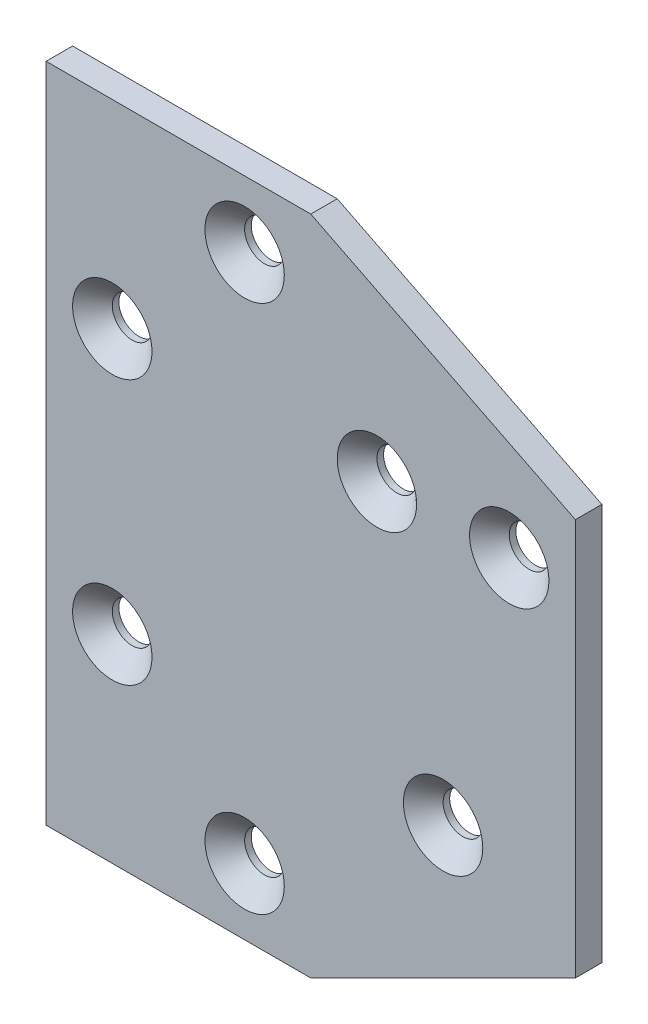
ISO-10303-21;
HEADER;
FILE_DESCRIPTION(('STEP AP214'),'2;1');
FILE_NAME('part.step','',(''),(''),'','','');
FILE_SCHEMA(('AUTOMOTIVE_DESIGN { 1 0 10303 214 1 1 1 1 }'));
ENDSEC;
DATA;
#1=APPLICATION_CONTEXT('core data for automotive mechanical design processes');
#2=APPLICATION_PROTOCOL_DEFINITION('international standard','automotive_design',2000,#1);
#3=PRODUCT_CONTEXT('',#1,'mechanical');
#4=PRODUCT('Part','Part','',(#3));
#5=PRODUCT_RELATED_PRODUCT_CATEGORY('part','',(#4));
#6=PRODUCT_DEFINITION_FORMATION('','',#4);
#7=PRODUCT_DEFINITION_CONTEXT('part definition',#1,'design');
#8=PRODUCT_DEFINITION('design','',#6,#7);
#9=PRODUCT_DEFINITION_SHAPE('','',#8);
#10=(LENGTH_UNIT() NAMED_UNIT(*) SI_UNIT(.MILLI.,.METRE.));
#11=(NAMED_UNIT(*) PLANE_ANGLE_UNIT() SI_UNIT($,.RADIAN.));
#12=(NAMED_UNIT(*) SI_UNIT($,.STERADIAN.) SOLID_ANGLE_UNIT());
#13=UNCERTAINTY_MEASURE_WITH_UNIT(LENGTH_MEASURE(1.E-05),#10,'distance_accuracy_value','');
#14=(GEOMETRIC_REPRESENTATION_CONTEXT(3) GLOBAL_UNCERTAINTY_ASSIGNED_CONTEXT((#13)) GLOBAL_UNIT_ASSIGNED_CONTEXT((#10,
#11,#12)) REPRESENTATION_CONTEXT('',''));
#15=CARTESIAN_POINT('',(0.,0.,0.));
#16=DIRECTION('',(0.,0.,1.));
#17=DIRECTION('',(1.,0.,0.));
#18=AXIS2_PLACEMENT_3D('',#15,#16,#17);
#19=CARTESIAN_POINT('',(0.,-50.,2.));
#20=DIRECTION('',(0.,1.,0.));
#21=DIRECTION('',(0.,0.,1.));
#22=AXIS2_PLACEMENT_3D('',#19,#20,#21);
#23=PLANE('',#22);
#24=DIRECTION('',(1.,0.,0.));
#25=VECTOR('',#24,1.);
#26=CARTESIAN_POINT('',(0.,-50.,-2.));
#27=LINE('',#26,#25);
#28=CARTESIAN_POINT('',(-20.,-50.,-2.));
#29=VERTEX_POINT('',#28);
#30=CARTESIAN_POINT('',(20.,-50.,-2.));
#31=VERTEX_POINT('',#30);
#32=EDGE_CURVE('E132',#29,#31,#27,.T.);
#33=ORIENTED_EDGE('',*,*,#32,.T.);
#34=DIRECTION('',(0.,0.,-1.));
#35=VECTOR('',#34,1.);
#36=CARTESIAN_POINT('',(20.,-50.,2.));
#37=LINE('',#36,#35);
#38=CARTESIAN_POINT('',(20.,-50.,2.));
#39=VERTEX_POINT('',#38);
#40=EDGE_CURVE('E153',#39,#31,#37,.T.);
#41=ORIENTED_EDGE('',*,*,#40,.F.);
#42=DIRECTION('',(1.,0.,0.));
#43=VECTOR('',#42,1.);
#44=CARTESIAN_POINT('',(0.,-50.,2.));
#45=LINE('',#44,#43);
#46=CARTESIAN_POINT('',(-20.,-50.,2.));
#47=VERTEX_POINT('',#46);
#48=EDGE_CURVE('E146',#47,#39,#45,.T.);
#49=ORIENTED_EDGE('',*,*,#48,.F.);
#50=DIRECTION('',(0.,0.,-1.));
#51=VECTOR('',#50,1.);
#52=CARTESIAN_POINT('',(-20.,-50.,2.));
#53=LINE('',#52,#51);
#54=EDGE_CURVE('E63',#47,#29,#53,.T.);
#55=ORIENTED_EDGE('',*,*,#54,.T.);
#56=EDGE_LOOP('',(#33,#41,#49,#55));
#57=FACE_BOUND('',#56,.T.);
#58=ADVANCED_FACE('F45',(#57),#23,.F.);
#59=CARTESIAN_POINT('',(24.,-48.,2.));
#60=DIRECTION('',(-0.447213595499958,0.894427190999916,0.));
#61=DIRECTION('',(-0.894427190999916,-0.447213595499958,0.));
#62=AXIS2_PLACEMENT_3D('',#59,#60,#61);
#63=PLANE('',#62);
#64=DIRECTION('',(0.894427190999916,0.447213595499958,0.));
#65=VECTOR('',#64,1.);
#66=CARTESIAN_POINT('',(24.,-48.,-2.));
#67=LINE('',#66,#65);
#68=CARTESIAN_POINT('',(60.,-30.,-2.));
#69=VERTEX_POINT('',#68);
#70=EDGE_CURVE('E134',#31,#69,#67,.T.);
#71=ORIENTED_EDGE('',*,*,#70,.T.);
#72=DIRECTION('',(0.,0.,-1.));
#73=VECTOR('',#72,1.);
#74=CARTESIAN_POINT('',(60.,-30.,2.));
#75=LINE('',#74,#73);
#76=CARTESIAN_POINT('',(60.,-30.,2.));
#77=VERTEX_POINT('',#76);
#78=EDGE_CURVE('E150',#77,#69,#75,.T.);
#79=ORIENTED_EDGE('',*,*,#78,.F.);
#80=DIRECTION('',(0.894427190999916,0.447213595499958,0.));
#81=VECTOR('',#80,1.);
#82=CARTESIAN_POINT('',(24.,-48.,2.));
#83=LINE('',#82,#81);
#84=EDGE_CURVE('E96',#39,#77,#83,.T.);
#85=ORIENTED_EDGE('',*,*,#84,.F.);
#86=ORIENTED_EDGE('',*,*,#40,.T.);
#87=EDGE_LOOP('',(#71,#79,#85,#86));
#88=FACE_BOUND('',#87,.T.);
#89=ADVANCED_FACE('F211',(#88),#63,.F.);
#90=CARTESIAN_POINT('',(60.,0.,2.));
#91=DIRECTION('',(-1.,0.,0.));
#92=DIRECTION('',(0.,0.,1.));
#93=AXIS2_PLACEMENT_3D('',#90,#91,#92);
#94=PLANE('',#93);
#95=DIRECTION('',(0.,1.,0.));
#96=VECTOR('',#95,1.);
#97=CARTESIAN_POINT('',(60.,0.,-2.));
#98=LINE('',#97,#96);
#99=CARTESIAN_POINT('',(60.,30.,-2.));
#100=VERTEX_POINT('',#99);
#101=EDGE_CURVE('E137',#69,#100,#98,.T.);
#102=ORIENTED_EDGE('',*,*,#101,.T.);
#103=DIRECTION('',(0.,0.,-1.));
#104=VECTOR('',#103,1.);
#105=CARTESIAN_POINT('',(60.,30.,2.));
#106=LINE('',#105,#104);
#107=CARTESIAN_POINT('',(60.,30.,2.));
#108=VERTEX_POINT('',#107);
#109=EDGE_CURVE('E115',#108,#100,#106,.T.);
#110=ORIENTED_EDGE('',*,*,#109,.F.);
#111=DIRECTION('',(0.,1.,0.));
#112=VECTOR('',#111,1.);
#113=CARTESIAN_POINT('',(60.,0.,2.));
#114=LINE('',#113,#112);
#115=EDGE_CURVE('E123',#77,#108,#114,.T.);
#116=ORIENTED_EDGE('',*,*,#115,.F.);
#117=ORIENTED_EDGE('',*,*,#78,.T.);
#118=EDGE_LOOP('',(#102,#110,#116,#117));
#119=FACE_BOUND('',#118,.T.);
#120=ADVANCED_FACE('F216',(#119),#94,.F.);
#121=CARTESIAN_POINT('',(24.,48.,2.));
#122=DIRECTION('',(0.447213595499958,0.894427190999916,0.));
#123=DIRECTION('',(-0.894427190999916,0.447213595499958,0.));
#124=AXIS2_PLACEMENT_3D('',#121,#122,#123);
#125=PLANE('',#124);
#126=DIRECTION('',(0.894427190999916,-0.447213595499958,0.));
#127=VECTOR('',#126,1.);
#128=CARTESIAN_POINT('',(24.,48.,-2.));
#129=LINE('',#128,#127);
#130=CARTESIAN_POINT('',(20.,50.,-2.));
#131=VERTEX_POINT('',#130);
#132=EDGE_CURVE('E111',#131,#100,#129,.T.);
#133=ORIENTED_EDGE('',*,*,#132,.F.);
#134=DIRECTION('',(0.,0.,-1.));
#135=VECTOR('',#134,1.);
#136=CARTESIAN_POINT('',(20.,50.,2.));
#137=LINE('',#136,#135);
#138=CARTESIAN_POINT('',(20.,50.,2.));
#139=VERTEX_POINT('',#138);
#140=EDGE_CURVE('E106',#139,#131,#137,.T.);
#141=ORIENTED_EDGE('',*,*,#140,.F.);
#142=DIRECTION('',(0.894427190999916,-0.447213595499958,0.));
#143=VECTOR('',#142,1.);
#144=CARTESIAN_POINT('',(24.,48.,2.));
#145=LINE('',#144,#143);
#146=EDGE_CURVE('E109',#139,#108,#145,.T.);
#147=ORIENTED_EDGE('',*,*,#146,.T.);
#148=ORIENTED_EDGE('',*,*,#109,.T.);
#149=EDGE_LOOP('',(#133,#141,#147,#148));
#150=FACE_BOUND('',#149,.T.);
#151=ADVANCED_FACE('F108',(#150),#125,.T.);
#152=CARTESIAN_POINT('',(0.,50.,2.));
#153=DIRECTION('',(0.,1.,0.));
#154=DIRECTION('',(0.,0.,1.));
#155=AXIS2_PLACEMENT_3D('',#152,#153,#154);
#156=PLANE('',#155);
#157=DIRECTION('',(1.,0.,0.));
#158=VECTOR('',#157,1.);
#159=CARTESIAN_POINT('',(0.,50.,-2.));
#160=LINE('',#159,#158);
#161=CARTESIAN_POINT('',(-20.,50.,-2.));
#162=VERTEX_POINT('',#161);
#163=EDGE_CURVE('E141',#162,#131,#160,.T.);
#164=ORIENTED_EDGE('',*,*,#163,.F.);
#165=DIRECTION('',(0.,0.,-1.));
#166=VECTOR('',#165,1.);
#167=CARTESIAN_POINT('',(-20.,50.,2.));
#168=LINE('',#167,#166);
#169=CARTESIAN_POINT('',(-20.,50.,2.));
#170=VERTEX_POINT('',#169);
#171=EDGE_CURVE('E83',#170,#162,#168,.T.);
#172=ORIENTED_EDGE('',*,*,#171,.F.);
#173=DIRECTION('',(1.,0.,0.));
#174=VECTOR('',#173,1.);
#175=CARTESIAN_POINT('',(0.,50.,2.));
#176=LINE('',#175,#174);
#177=EDGE_CURVE('E121',#170,#139,#176,.T.);
#178=ORIENTED_EDGE('',*,*,#177,.T.);
#179=ORIENTED_EDGE('',*,*,#140,.T.);
#180=EDGE_LOOP('',(#164,#172,#178,#179));
#181=FACE_BOUND('',#180,.T.);
#182=ADVANCED_FACE('F126',(#181),#156,.T.);
#183=CARTESIAN_POINT('',(-20.,0.,2.));
#184=DIRECTION('',(-1.,0.,0.));
#185=DIRECTION('',(0.,0.,1.));
#186=AXIS2_PLACEMENT_3D('',#183,#184,#185);
#187=PLANE('',#186);
#188=DIRECTION('',(0.,1.,0.));
#189=VECTOR('',#188,1.);
#190=CARTESIAN_POINT('',(-20.,0.,-2.));
#191=LINE('',#190,#189);
#192=EDGE_CURVE('E143',#29,#162,#191,.T.);
#193=ORIENTED_EDGE('',*,*,#192,.F.);
#194=ORIENTED_EDGE('',*,*,#54,.F.);
#195=DIRECTION('',(0.,1.,0.));
#196=VECTOR('',#195,1.);
#197=CARTESIAN_POINT('',(-20.,0.,2.));
#198=LINE('',#197,#196);
#199=EDGE_CURVE('E127',#47,#170,#198,.T.);
#200=ORIENTED_EDGE('',*,*,#199,.T.);
#201=ORIENTED_EDGE('',*,*,#171,.T.);
#202=EDGE_LOOP('',(#193,#194,#200,#201));
#203=FACE_BOUND('',#202,.T.);
#204=ADVANCED_FACE('F295',(#203),#187,.T.);
#205=CARTESIAN_POINT('',(0.,0.,2.));
#206=DIRECTION('',(0.,0.,1.));
#207=DIRECTION('',(1.,0.,0.));
#208=AXIS2_PLACEMENT_3D('',#205,#206,#207);
#209=PLANE('',#208);
#210=CARTESIAN_POINT('',(10.,-40.,2.));
#211=DIRECTION('',(0.,0.,1.));
#212=DIRECTION('',(1.,0.,0.));
#213=AXIS2_PLACEMENT_3D('',#210,#211,#212);
#214=CIRCLE('',#213,6.00000000000001);
#215=CARTESIAN_POINT('',(16.,-40.,2.));
#216=VERTEX_POINT('',#215);
#217=EDGE_CURVE('E176',#216,#216,#214,.F.);
#218=ORIENTED_EDGE('',*,*,#217,.T.);
#219=EDGE_LOOP('',(#218));
#220=FACE_BOUND('',#219,.T.);
#221=CARTESIAN_POINT('',(40.,-20.,2.));
#222=DIRECTION('',(0.,0.,1.));
#223=DIRECTION('',(1.,0.,0.));
#224=AXIS2_PLACEMENT_3D('',#221,#222,#223);
#225=CIRCLE('',#224,6.00000000000001);
#226=CARTESIAN_POINT('',(46.,-20.,2.));
#227=VERTEX_POINT('',#226);
#228=EDGE_CURVE('E173',#227,#227,#225,.F.);
#229=ORIENTED_EDGE('',*,*,#228,.T.);
#230=EDGE_LOOP('',(#229));
#231=FACE_BOUND('',#230,.T.);
#232=CARTESIAN_POINT('',(-10.,-20.,2.));
#233=DIRECTION('',(0.,0.,1.));
#234=DIRECTION('',(1.,0.,0.));
#235=AXIS2_PLACEMENT_3D('',#232,#233,#234);
#236=CIRCLE('',#235,6.00000000000001);
#237=CARTESIAN_POINT('',(-4.,-20.,2.));
#238=VERTEX_POINT('',#237);
#239=EDGE_CURVE('E170',#238,#238,#236,.F.);
#240=ORIENTED_EDGE('',*,*,#239,.T.);
#241=EDGE_LOOP('',(#240));
#242=FACE_BOUND('',#241,.T.);
#243=CARTESIAN_POINT('',(50.,20.,2.));
#244=DIRECTION('',(0.,0.,1.));
#245=DIRECTION('',(1.,0.,0.));
#246=AXIS2_PLACEMENT_3D('',#243,#244,#245);
#247=CIRCLE('',#246,6.00000000000001);
#248=CARTESIAN_POINT('',(56.,20.,2.));
#249=VERTEX_POINT('',#248);
#250=EDGE_CURVE('E167',#249,#249,#247,.F.);
#251=ORIENTED_EDGE('',*,*,#250,.T.);
#252=EDGE_LOOP('',(#251));
#253=FACE_BOUND('',#252,.T.);
#254=CARTESIAN_POINT('',(30.,20.,2.));
#255=DIRECTION('',(0.,0.,1.));
#256=DIRECTION('',(1.,0.,0.));
#257=AXIS2_PLACEMENT_3D('',#254,#255,#256);
#258=CIRCLE('',#257,6.00000000000001);
#259=CARTESIAN_POINT('',(36.,20.,2.));
#260=VERTEX_POINT('',#259);
#261=EDGE_CURVE('E164',#260,#260,#258,.F.);
#262=ORIENTED_EDGE('',*,*,#261,.T.);
#263=EDGE_LOOP('',(#262));
#264=FACE_BOUND('',#263,.T.);
#265=CARTESIAN_POINT('',(9.99999999999998,40.,2.));
#266=DIRECTION('',(0.,0.,1.));
#267=DIRECTION('',(1.,0.,0.));
#268=AXIS2_PLACEMENT_3D('',#265,#266,#267);
#269=CIRCLE('',#268,6.00000000000001);
#270=CARTESIAN_POINT('',(16.,40.,2.));
#271=VERTEX_POINT('',#270);
#272=EDGE_CURVE('E161',#271,#271,#269,.F.);
#273=ORIENTED_EDGE('',*,*,#272,.T.);
#274=EDGE_LOOP('',(#273));
#275=FACE_BOUND('',#274,.T.);
#276=CARTESIAN_POINT('',(-10.,20.,2.));
#277=DIRECTION('',(0.,0.,1.));
#278=DIRECTION('',(1.,0.,0.));
#279=AXIS2_PLACEMENT_3D('',#276,#277,#278);
#280=CIRCLE('',#279,6.);
#281=CARTESIAN_POINT('',(-4.,20.,2.));
#282=VERTEX_POINT('',#281);
#283=EDGE_CURVE('E158',#282,#282,#280,.F.);
#284=ORIENTED_EDGE('',*,*,#283,.T.);
#285=EDGE_LOOP('',(#284));
#286=FACE_BOUND('',#285,.T.);
#287=ORIENTED_EDGE('',*,*,#48,.T.);
#288=ORIENTED_EDGE('',*,*,#84,.T.);
#289=ORIENTED_EDGE('',*,*,#115,.T.);
#290=ORIENTED_EDGE('',*,*,#146,.F.);
#291=ORIENTED_EDGE('',*,*,#177,.F.);
#292=ORIENTED_EDGE('',*,*,#199,.F.);
#293=EDGE_LOOP('',(#287,#288,#289,#290,#291,#292));
#294=FACE_BOUND('',#293,.T.);
#295=ADVANCED_FACE('F119',(#220,#231,#242,#253,#264,#275,#286,#294),#209,.T.);
#296=CARTESIAN_POINT('',(0.,0.,-2.));
#297=DIRECTION('',(0.,0.,1.));
#298=DIRECTION('',(1.,0.,0.));
#299=AXIS2_PLACEMENT_3D('',#296,#297,#298);
#300=PLANE('',#299);
#301=CARTESIAN_POINT('',(40.,-20.,-2.));
#302=DIRECTION('',(0.,0.,1.));
#303=DIRECTION('',(1.,0.,0.));
#304=AXIS2_PLACEMENT_3D('',#301,#302,#303);
#305=CIRCLE('',#304,3.);
#306=CARTESIAN_POINT('',(43.,-20.,-2.));
#307=VERTEX_POINT('',#306);
#308=EDGE_CURVE('E273',#307,#307,#305,.T.);
#309=ORIENTED_EDGE('',*,*,#308,.T.);
#310=EDGE_LOOP('',(#309));
#311=FACE_BOUND('',#310,.T.);
#312=CARTESIAN_POINT('',(10.,-40.,-2.));
#313=DIRECTION('',(0.,0.,1.));
#314=DIRECTION('',(1.,0.,0.));
#315=AXIS2_PLACEMENT_3D('',#312,#313,#314);
#316=CIRCLE('',#315,3.);
#317=CARTESIAN_POINT('',(13.,-40.,-2.));
#318=VERTEX_POINT('',#317);
#319=EDGE_CURVE('E276',#318,#318,#316,.T.);
#320=ORIENTED_EDGE('',*,*,#319,.T.);
#321=EDGE_LOOP('',(#320));
#322=FACE_BOUND('',#321,.T.);
#323=CARTESIAN_POINT('',(-10.,-20.,-2.));
#324=DIRECTION('',(0.,0.,1.));
#325=DIRECTION('',(1.,0.,0.));
#326=AXIS2_PLACEMENT_3D('',#323,#324,#325);
#327=CIRCLE('',#326,3.);
#328=CARTESIAN_POINT('',(-7.,-20.,-2.));
#329=VERTEX_POINT('',#328);
#330=EDGE_CURVE('E279',#329,#329,#327,.T.);
#331=ORIENTED_EDGE('',*,*,#330,.T.);
#332=EDGE_LOOP('',(#331));
#333=FACE_BOUND('',#332,.T.);
#334=CARTESIAN_POINT('',(9.99999999999998,40.,-2.));
#335=DIRECTION('',(0.,0.,1.));
#336=DIRECTION('',(1.,0.,0.));
#337=AXIS2_PLACEMENT_3D('',#334,#335,#336);
#338=CIRCLE('',#337,3.);
#339=CARTESIAN_POINT('',(13.,40.,-2.));
#340=VERTEX_POINT('',#339);
#341=EDGE_CURVE('E282',#340,#340,#338,.T.);
#342=ORIENTED_EDGE('',*,*,#341,.T.);
#343=EDGE_LOOP('',(#342));
#344=FACE_BOUND('',#343,.T.);
#345=CARTESIAN_POINT('',(30.,20.,-2.));
#346=DIRECTION('',(0.,0.,1.));
#347=DIRECTION('',(1.,0.,0.));
#348=AXIS2_PLACEMENT_3D('',#345,#346,#347);
#349=CIRCLE('',#348,3.);
#350=CARTESIAN_POINT('',(33.,20.,-2.));
#351=VERTEX_POINT('',#350);
#352=EDGE_CURVE('E270',#351,#351,#349,.T.);
#353=ORIENTED_EDGE('',*,*,#352,.T.);
#354=EDGE_LOOP('',(#353));
#355=FACE_BOUND('',#354,.T.);
#356=CARTESIAN_POINT('',(50.,20.,-2.));
#357=DIRECTION('',(0.,0.,1.));
#358=DIRECTION('',(1.,0.,0.));
#359=AXIS2_PLACEMENT_3D('',#356,#357,#358);
#360=CIRCLE('',#359,3.);
#361=CARTESIAN_POINT('',(53.,20.,-2.));
#362=VERTEX_POINT('',#361);
#363=EDGE_CURVE('E268',#362,#362,#360,.T.);
#364=ORIENTED_EDGE('',*,*,#363,.T.);
#365=EDGE_LOOP('',(#364));
#366=FACE_BOUND('',#365,.T.);
#367=CARTESIAN_POINT('',(-10.,20.,-2.));
#368=DIRECTION('',(0.,0.,1.));
#369=DIRECTION('',(1.,0.,0.));
#370=AXIS2_PLACEMENT_3D('',#367,#368,#369);
#371=CIRCLE('',#370,3.);
#372=CARTESIAN_POINT('',(-7.00000000000001,20.,-2.));
#373=VERTEX_POINT('',#372);
#374=EDGE_CURVE('E135',#373,#373,#371,.T.);
#375=ORIENTED_EDGE('',*,*,#374,.T.);
#376=EDGE_LOOP('',(#375));
#377=FACE_BOUND('',#376,.T.);
#378=ORIENTED_EDGE('',*,*,#32,.F.);
#379=ORIENTED_EDGE('',*,*,#192,.T.);
#380=ORIENTED_EDGE('',*,*,#163,.T.);
#381=ORIENTED_EDGE('',*,*,#132,.T.);
#382=ORIENTED_EDGE('',*,*,#101,.F.);
#383=ORIENTED_EDGE('',*,*,#70,.F.);
#384=EDGE_LOOP('',(#378,#379,#380,#381,#382,#383));
#385=FACE_BOUND('',#384,.T.);
#386=ADVANCED_FACE('F294',(#311,#322,#333,#344,#355,#366,#377,#385),#300,.F.);
#387=CARTESIAN_POINT('',(-10.,20.,-2.));
#388=DIRECTION('',(0.,0.,1.));
#389=DIRECTION('',(1.,0.,0.));
#390=AXIS2_PLACEMENT_3D('',#387,#388,#389);
#391=CYLINDRICAL_SURFACE('',#390,3.);
#392=CARTESIAN_POINT('',(-10.,20.,-1.));
#393=DIRECTION('',(0.,0.,1.));
#394=DIRECTION('',(1.,0.,0.));
#395=AXIS2_PLACEMENT_3D('',#392,#393,#394);
#396=CIRCLE('',#395,3.);
#397=CARTESIAN_POINT('',(-7.00000000000001,20.,-1.));
#398=VERTEX_POINT('',#397);
#399=EDGE_CURVE('E11',#398,#398,#396,.T.);
#400=ORIENTED_EDGE('',*,*,#399,.T.);
#401=EDGE_LOOP('',(#400));
#402=FACE_BOUND('',#401,.T.);
#403=ORIENTED_EDGE('',*,*,#374,.F.);
#404=EDGE_LOOP('',(#403));
#405=FACE_BOUND('',#404,.T.);
#406=ADVANCED_FACE('F264',(#402,#405),#391,.F.);
#407=CARTESIAN_POINT('',(50.,20.,-2.));
#408=DIRECTION('',(0.,0.,1.));
#409=DIRECTION('',(1.,0.,0.));
#410=AXIS2_PLACEMENT_3D('',#407,#408,#409);
#411=CYLINDRICAL_SURFACE('',#410,3.);
#412=CARTESIAN_POINT('',(50.,20.,-1.));
#413=DIRECTION('',(0.,0.,1.));
#414=DIRECTION('',(1.,0.,0.));
#415=AXIS2_PLACEMENT_3D('',#412,#413,#414);
#416=CIRCLE('',#415,3.);
#417=CARTESIAN_POINT('',(53.,20.,-1.));
#418=VERTEX_POINT('',#417);
#419=EDGE_CURVE('E185',#418,#418,#416,.T.);
#420=ORIENTED_EDGE('',*,*,#419,.T.);
#421=EDGE_LOOP('',(#420));
#422=FACE_BOUND('',#421,.T.);
#423=ORIENTED_EDGE('',*,*,#363,.F.);
#424=EDGE_LOOP('',(#423));
#425=FACE_BOUND('',#424,.T.);
#426=ADVANCED_FACE('F260',(#422,#425),#411,.F.);
#427=CARTESIAN_POINT('',(30.,20.,-2.));
#428=DIRECTION('',(0.,0.,1.));
#429=DIRECTION('',(1.,0.,0.));
#430=AXIS2_PLACEMENT_3D('',#427,#428,#429);
#431=CYLINDRICAL_SURFACE('',#430,3.);
#432=CARTESIAN_POINT('',(30.,20.,-1.));
#433=DIRECTION('',(0.,0.,1.));
#434=DIRECTION('',(1.,0.,0.));
#435=AXIS2_PLACEMENT_3D('',#432,#433,#434);
#436=CIRCLE('',#435,3.);
#437=CARTESIAN_POINT('',(33.,20.,-1.));
#438=VERTEX_POINT('',#437);
#439=EDGE_CURVE('E188',#438,#438,#436,.T.);
#440=ORIENTED_EDGE('',*,*,#439,.T.);
#441=EDGE_LOOP('',(#440));
#442=FACE_BOUND('',#441,.T.);
#443=ORIENTED_EDGE('',*,*,#352,.F.);
#444=EDGE_LOOP('',(#443));
#445=FACE_BOUND('',#444,.T.);
#446=ADVANCED_FACE('F263',(#442,#445),#431,.F.);
#447=CARTESIAN_POINT('',(9.99999999999998,40.,-2.));
#448=DIRECTION('',(0.,0.,1.));
#449=DIRECTION('',(1.,0.,0.));
#450=AXIS2_PLACEMENT_3D('',#447,#448,#449);
#451=CYLINDRICAL_SURFACE('',#450,3.);
#452=CARTESIAN_POINT('',(9.99999999999998,40.,-1.));
#453=DIRECTION('',(0.,0.,1.));
#454=DIRECTION('',(1.,0.,0.));
#455=AXIS2_PLACEMENT_3D('',#452,#453,#454);
#456=CIRCLE('',#455,3.);
#457=CARTESIAN_POINT('',(13.,40.,-1.));
#458=VERTEX_POINT('',#457);
#459=EDGE_CURVE('E55',#458,#458,#456,.T.);
#460=ORIENTED_EDGE('',*,*,#459,.T.);
#461=EDGE_LOOP('',(#460));
#462=FACE_BOUND('',#461,.T.);
#463=ORIENTED_EDGE('',*,*,#341,.F.);
#464=EDGE_LOOP('',(#463));
#465=FACE_BOUND('',#464,.T.);
#466=ADVANCED_FACE('F193',(#462,#465),#451,.F.);
#467=CARTESIAN_POINT('',(-10.,-20.,-2.));
#468=DIRECTION('',(0.,0.,1.));
#469=DIRECTION('',(1.,0.,0.));
#470=AXIS2_PLACEMENT_3D('',#467,#468,#469);
#471=CYLINDRICAL_SURFACE('',#470,3.);
#472=CARTESIAN_POINT('',(-10.,-20.,-1.));
#473=DIRECTION('',(0.,0.,1.));
#474=DIRECTION('',(1.,0.,0.));
#475=AXIS2_PLACEMENT_3D('',#472,#473,#474);
#476=CIRCLE('',#475,3.);
#477=CARTESIAN_POINT('',(-7.,-20.,-1.));
#478=VERTEX_POINT('',#477);
#479=EDGE_CURVE('E182',#478,#478,#476,.T.);
#480=ORIENTED_EDGE('',*,*,#479,.T.);
#481=EDGE_LOOP('',(#480));
#482=FACE_BOUND('',#481,.T.);
#483=ORIENTED_EDGE('',*,*,#330,.F.);
#484=EDGE_LOOP('',(#483));
#485=FACE_BOUND('',#484,.T.);
#486=ADVANCED_FACE('F381',(#482,#485),#471,.F.);
#487=CARTESIAN_POINT('',(10.,-40.,-2.));
#488=DIRECTION('',(0.,0.,1.));
#489=DIRECTION('',(1.,0.,0.));
#490=AXIS2_PLACEMENT_3D('',#487,#488,#489);
#491=CYLINDRICAL_SURFACE('',#490,3.);
#492=CARTESIAN_POINT('',(10.,-40.,-1.));
#493=DIRECTION('',(0.,0.,1.));
#494=DIRECTION('',(1.,0.,0.));
#495=AXIS2_PLACEMENT_3D('',#492,#493,#494);
#496=CIRCLE('',#495,3.);
#497=CARTESIAN_POINT('',(13.,-40.,-1.));
#498=VERTEX_POINT('',#497);
#499=EDGE_CURVE('E155',#498,#498,#496,.T.);
#500=ORIENTED_EDGE('',*,*,#499,.T.);
#501=EDGE_LOOP('',(#500));
#502=FACE_BOUND('',#501,.T.);
#503=ORIENTED_EDGE('',*,*,#319,.F.);
#504=EDGE_LOOP('',(#503));
#505=FACE_BOUND('',#504,.T.);
#506=ADVANCED_FACE('F391',(#502,#505),#491,.F.);
#507=CARTESIAN_POINT('',(40.,-20.,-2.));
#508=DIRECTION('',(0.,0.,1.));
#509=DIRECTION('',(1.,0.,0.));
#510=AXIS2_PLACEMENT_3D('',#507,#508,#509);
#511=CYLINDRICAL_SURFACE('',#510,3.);
#512=CARTESIAN_POINT('',(40.,-20.,-1.));
#513=DIRECTION('',(0.,0.,1.));
#514=DIRECTION('',(1.,0.,0.));
#515=AXIS2_PLACEMENT_3D('',#512,#513,#514);
#516=CIRCLE('',#515,3.);
#517=CARTESIAN_POINT('',(43.,-20.,-1.));
#518=VERTEX_POINT('',#517);
#519=EDGE_CURVE('E179',#518,#518,#516,.T.);
#520=ORIENTED_EDGE('',*,*,#519,.T.);
#521=EDGE_LOOP('',(#520));
#522=FACE_BOUND('',#521,.T.);
#523=ORIENTED_EDGE('',*,*,#308,.F.);
#524=EDGE_LOOP('',(#523));
#525=FACE_BOUND('',#524,.T.);
#526=ADVANCED_FACE('F228',(#522,#525),#511,.F.);
#527=CARTESIAN_POINT('',(10.,-40.,-1.));
#528=DIRECTION('',(0.,0.,1.));
#529=DIRECTION('',(1.,0.,0.));
#530=AXIS2_PLACEMENT_3D('',#527,#528,#529);
#531=CONICAL_SURFACE('',#530,3.,0.785398163397449);
#532=ORIENTED_EDGE('',*,*,#217,.F.);
#533=EDGE_LOOP('',(#532));
#534=FACE_BOUND('',#533,.T.);
#535=ORIENTED_EDGE('',*,*,#499,.F.);
#536=EDGE_LOOP('',(#535));
#537=FACE_BOUND('',#536,.T.);
#538=ADVANCED_FACE('F221',(#534,#537),#531,.F.);
#539=CARTESIAN_POINT('',(40.,-20.,-1.));
#540=DIRECTION('',(0.,0.,1.));
#541=DIRECTION('',(1.,0.,0.));
#542=AXIS2_PLACEMENT_3D('',#539,#540,#541);
#543=CONICAL_SURFACE('',#542,3.,0.785398163397449);
#544=ORIENTED_EDGE('',*,*,#228,.F.);
#545=EDGE_LOOP('',(#544));
#546=FACE_BOUND('',#545,.T.);
#547=ORIENTED_EDGE('',*,*,#519,.F.);
#548=EDGE_LOOP('',(#547));
#549=FACE_BOUND('',#548,.T.);
#550=ADVANCED_FACE('F227',(#546,#549),#543,.F.);
#551=CARTESIAN_POINT('',(-10.,-20.,-1.));
#552=DIRECTION('',(0.,0.,1.));
#553=DIRECTION('',(1.,0.,0.));
#554=AXIS2_PLACEMENT_3D('',#551,#552,#553);
#555=CONICAL_SURFACE('',#554,3.,0.785398163397449);
#556=ORIENTED_EDGE('',*,*,#239,.F.);
#557=EDGE_LOOP('',(#556));
#558=FACE_BOUND('',#557,.T.);
#559=ORIENTED_EDGE('',*,*,#479,.F.);
#560=EDGE_LOOP('',(#559));
#561=FACE_BOUND('',#560,.T.);
#562=ADVANCED_FACE('F235',(#558,#561),#555,.F.);
#563=CARTESIAN_POINT('',(50.,20.,-1.));
#564=DIRECTION('',(0.,0.,1.));
#565=DIRECTION('',(1.,0.,0.));
#566=AXIS2_PLACEMENT_3D('',#563,#564,#565);
#567=CONICAL_SURFACE('',#566,3.,0.785398163397449);
#568=ORIENTED_EDGE('',*,*,#250,.F.);
#569=EDGE_LOOP('',(#568));
#570=FACE_BOUND('',#569,.T.);
#571=ORIENTED_EDGE('',*,*,#419,.F.);
#572=EDGE_LOOP('',(#571));
#573=FACE_BOUND('',#572,.T.);
#574=ADVANCED_FACE('F205',(#570,#573),#567,.F.);
#575=CARTESIAN_POINT('',(30.,20.,-1.));
#576=DIRECTION('',(0.,0.,1.));
#577=DIRECTION('',(1.,0.,0.));
#578=AXIS2_PLACEMENT_3D('',#575,#576,#577);
#579=CONICAL_SURFACE('',#578,3.,0.785398163397449);
#580=ORIENTED_EDGE('',*,*,#261,.F.);
#581=EDGE_LOOP('',(#580));
#582=FACE_BOUND('',#581,.T.);
#583=ORIENTED_EDGE('',*,*,#439,.F.);
#584=EDGE_LOOP('',(#583));
#585=FACE_BOUND('',#584,.T.);
#586=ADVANCED_FACE('F198',(#582,#585),#579,.F.);
#587=CARTESIAN_POINT('',(9.99999999999998,40.,-1.));
#588=DIRECTION('',(0.,0.,1.));
#589=DIRECTION('',(1.,0.,0.));
#590=AXIS2_PLACEMENT_3D('',#587,#588,#589);
#591=CONICAL_SURFACE('',#590,3.,0.785398163397449);
#592=ORIENTED_EDGE('',*,*,#272,.F.);
#593=EDGE_LOOP('',(#592));
#594=FACE_BOUND('',#593,.T.);
#595=ORIENTED_EDGE('',*,*,#459,.F.);
#596=EDGE_LOOP('',(#595));
#597=FACE_BOUND('',#596,.T.);
#598=ADVANCED_FACE('F196',(#594,#597),#591,.F.);
#599=CARTESIAN_POINT('',(-10.,20.,-1.));
#600=DIRECTION('',(0.,0.,1.));
#601=DIRECTION('',(1.,0.,0.));
#602=AXIS2_PLACEMENT_3D('',#599,#600,#601);
#603=CONICAL_SURFACE('',#602,3.,0.785398163397449);
#604=ORIENTED_EDGE('',*,*,#283,.F.);
#605=EDGE_LOOP('',(#604));
#606=FACE_BOUND('',#605,.T.);
#607=ORIENTED_EDGE('',*,*,#399,.F.);
#608=EDGE_LOOP('',(#607));
#609=FACE_BOUND('',#608,.T.);
#610=ADVANCED_FACE('F48',(#606,#609),#603,.F.);
#611=CLOSED_SHELL('',(#58,#89,#120,#151,#182,#204,#295,#386,#406,#426,#446,#466,#486,#506,#526,
#538,#550,#562,#574,#586,#598,#610));
#612=MANIFOLD_SOLID_BREP('B2',#611);
#613=ADVANCED_BREP_SHAPE_REPRESENTATION('',(#18,#612),#14);
#614=SHAPE_DEFINITION_REPRESENTATION(#9,#613);
ENDSEC;
END-ISO-10303-21;
